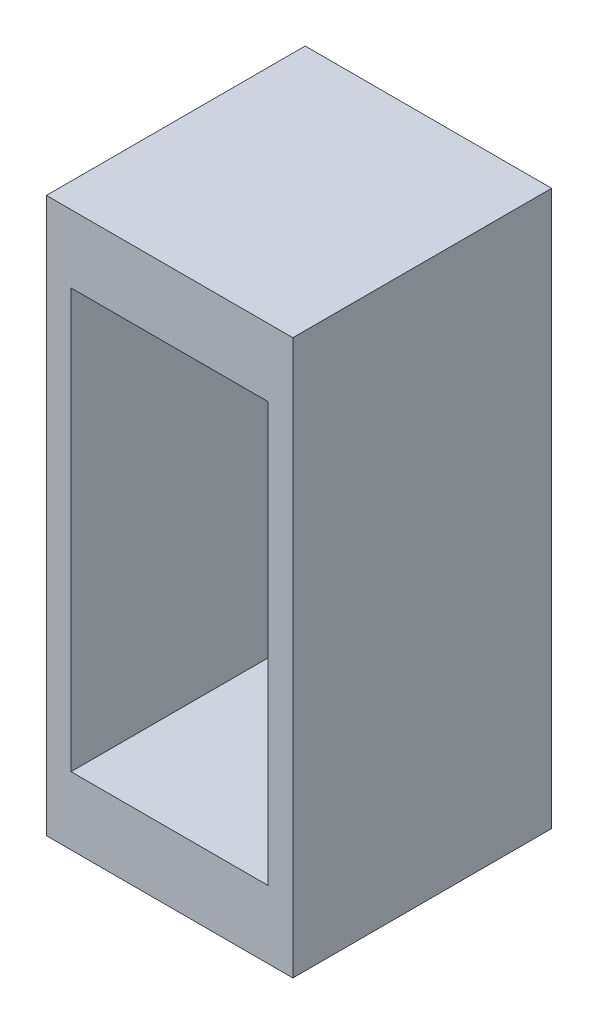
ISO-10303-21;
HEADER;
FILE_DESCRIPTION(('STEP AP214'),'2;1');
FILE_NAME('part.step','',(''),(''),'','','');
FILE_SCHEMA(('AUTOMOTIVE_DESIGN { 1 0 10303 214 1 1 1 1 }'));
ENDSEC;
DATA;
#1=APPLICATION_CONTEXT('core data for automotive mechanical design processes');
#2=APPLICATION_PROTOCOL_DEFINITION('international standard','automotive_design',2000,#1);
#3=PRODUCT_CONTEXT('',#1,'mechanical');
#4=PRODUCT('Part','Part','',(#3));
#5=PRODUCT_RELATED_PRODUCT_CATEGORY('part','',(#4));
#6=PRODUCT_DEFINITION_FORMATION('','',#4);
#7=PRODUCT_DEFINITION_CONTEXT('part definition',#1,'design');
#8=PRODUCT_DEFINITION('design','',#6,#7);
#9=PRODUCT_DEFINITION_SHAPE('','',#8);
#10=(LENGTH_UNIT() NAMED_UNIT(*) SI_UNIT(.MILLI.,.METRE.));
#11=(NAMED_UNIT(*) PLANE_ANGLE_UNIT() SI_UNIT($,.RADIAN.));
#12=(NAMED_UNIT(*) SI_UNIT($,.STERADIAN.) SOLID_ANGLE_UNIT());
#13=UNCERTAINTY_MEASURE_WITH_UNIT(LENGTH_MEASURE(1.E-05),#10,'distance_accuracy_value','');
#14=(GEOMETRIC_REPRESENTATION_CONTEXT(3) GLOBAL_UNCERTAINTY_ASSIGNED_CONTEXT((#13)) GLOBAL_UNIT_ASSIGNED_CONTEXT((#10,
#11,#12)) REPRESENTATION_CONTEXT('',''));
#15=CARTESIAN_POINT('',(0.,0.,0.));
#16=DIRECTION('',(0.,0.,1.));
#17=DIRECTION('',(1.,0.,0.));
#18=AXIS2_PLACEMENT_3D('',#15,#16,#17);
#19=CARTESIAN_POINT('',(0.,0.,26.67));
#20=DIRECTION('',(0.,0.,1.));
#21=DIRECTION('',(1.,0.,0.));
#22=AXIS2_PLACEMENT_3D('',#19,#20,#21);
#23=PLANE('',#22);
#24=DIRECTION('',(0.,-1.,0.));
#25=VECTOR('',#24,1.);
#26=CARTESIAN_POINT('',(-12.7,-28.575,26.67));
#27=LINE('',#26,#25);
#28=CARTESIAN_POINT('',(-12.7,28.575,26.67));
#29=VERTEX_POINT('',#28);
#30=CARTESIAN_POINT('',(-12.7,-28.575,26.67));
#31=VERTEX_POINT('',#30);
#32=EDGE_CURVE('E156',#29,#31,#27,.T.);
#33=ORIENTED_EDGE('',*,*,#32,.T.);
#34=DIRECTION('',(1.,0.,0.));
#35=VECTOR('',#34,1.);
#36=CARTESIAN_POINT('',(12.7,-28.575,26.67));
#37=LINE('',#36,#35);
#38=CARTESIAN_POINT('',(12.7,-28.575,26.67));
#39=VERTEX_POINT('',#38);
#40=EDGE_CURVE('E182',#31,#39,#37,.T.);
#41=ORIENTED_EDGE('',*,*,#40,.T.);
#42=DIRECTION('',(0.,1.,0.));
#43=VECTOR('',#42,1.);
#44=CARTESIAN_POINT('',(12.7,-28.575,26.67));
#45=LINE('',#44,#43);
#46=CARTESIAN_POINT('',(12.7,28.575,26.67));
#47=VERTEX_POINT('',#46);
#48=EDGE_CURVE('E170',#39,#47,#45,.T.);
#49=ORIENTED_EDGE('',*,*,#48,.T.);
#50=DIRECTION('',(-1.,0.,0.));
#51=VECTOR('',#50,1.);
#52=CARTESIAN_POINT('',(12.7,28.575,26.67));
#53=LINE('',#52,#51);
#54=EDGE_CURVE('E161',#47,#29,#53,.T.);
#55=ORIENTED_EDGE('',*,*,#54,.T.);
#56=EDGE_LOOP('',(#33,#41,#49,#55));
#57=FACE_BOUND('',#56,.T.);
#58=DIRECTION('',(-1.,0.,0.));
#59=VECTOR('',#58,1.);
#60=CARTESIAN_POINT('',(-10.16,21.59,26.67));
#61=LINE('',#60,#59);
#62=CARTESIAN_POINT('',(10.16,21.59,26.67));
#63=VERTEX_POINT('',#62);
#64=CARTESIAN_POINT('',(-10.16,21.59,26.67));
#65=VERTEX_POINT('',#64);
#66=EDGE_CURVE('E195',#63,#65,#61,.T.);
#67=ORIENTED_EDGE('',*,*,#66,.F.);
#68=DIRECTION('',(0.,1.,0.));
#69=VECTOR('',#68,1.);
#70=CARTESIAN_POINT('',(10.16,-21.59,26.67));
#71=LINE('',#70,#69);
#72=CARTESIAN_POINT('',(10.16,-21.59,26.67));
#73=VERTEX_POINT('',#72);
#74=EDGE_CURVE('E197',#73,#63,#71,.T.);
#75=ORIENTED_EDGE('',*,*,#74,.F.);
#76=DIRECTION('',(1.,0.,0.));
#77=VECTOR('',#76,1.);
#78=CARTESIAN_POINT('',(-10.16,-21.59,26.67));
#79=LINE('',#78,#77);
#80=CARTESIAN_POINT('',(-10.16,-21.59,26.67));
#81=VERTEX_POINT('',#80);
#82=EDGE_CURVE('E203',#81,#73,#79,.T.);
#83=ORIENTED_EDGE('',*,*,#82,.F.);
#84=DIRECTION('',(0.,-1.,0.));
#85=VECTOR('',#84,1.);
#86=CARTESIAN_POINT('',(-10.16,-21.59,26.67));
#87=LINE('',#86,#85);
#88=EDGE_CURVE('E198',#65,#81,#87,.T.);
#89=ORIENTED_EDGE('',*,*,#88,.F.);
#90=EDGE_LOOP('',(#67,#75,#83,#89));
#91=FACE_BOUND('',#90,.T.);
#92=ADVANCED_FACE('F33',(#57,#91),#23,.T.);
#93=CARTESIAN_POINT('',(0.,0.,0.));
#94=DIRECTION('',(0.,0.,1.));
#95=DIRECTION('',(1.,0.,0.));
#96=AXIS2_PLACEMENT_3D('',#93,#94,#95);
#97=PLANE('',#96);
#98=DIRECTION('',(1.,0.,0.));
#99=VECTOR('',#98,1.);
#100=CARTESIAN_POINT('',(-10.16,-21.59,0.));
#101=LINE('',#100,#99);
#102=CARTESIAN_POINT('',(-10.16,-21.59,0.));
#103=VERTEX_POINT('',#102);
#104=CARTESIAN_POINT('',(-6.35000000000001,-21.59,0.));
#105=VERTEX_POINT('',#104);
#106=EDGE_CURVE('E140',#103,#105,#101,.T.);
#107=ORIENTED_EDGE('',*,*,#106,.T.);
#108=DIRECTION('',(0.,1.,0.));
#109=VECTOR('',#108,1.);
#110=CARTESIAN_POINT('',(-6.35000000000002,28.576,0.));
#111=LINE('',#110,#109);
#112=CARTESIAN_POINT('',(-6.35000000000001,-28.575,0.));
#113=VERTEX_POINT('',#112);
#114=EDGE_CURVE('E124',#113,#105,#111,.T.);
#115=ORIENTED_EDGE('',*,*,#114,.F.);
#116=DIRECTION('',(1.,0.,0.));
#117=VECTOR('',#116,1.);
#118=CARTESIAN_POINT('',(12.7,-28.575,0.));
#119=LINE('',#118,#117);
#120=CARTESIAN_POINT('',(-12.7,-28.575,0.));
#121=VERTEX_POINT('',#120);
#122=EDGE_CURVE('E138',#121,#113,#119,.T.);
#123=ORIENTED_EDGE('',*,*,#122,.F.);
#124=DIRECTION('',(0.,-1.,0.));
#125=VECTOR('',#124,1.);
#126=CARTESIAN_POINT('',(-12.7,-28.575,0.));
#127=LINE('',#126,#125);
#128=CARTESIAN_POINT('',(-12.7,28.575,0.));
#129=VERTEX_POINT('',#128);
#130=EDGE_CURVE('E151',#129,#121,#127,.T.);
#131=ORIENTED_EDGE('',*,*,#130,.F.);
#132=DIRECTION('',(-1.,0.,0.));
#133=VECTOR('',#132,1.);
#134=CARTESIAN_POINT('',(12.7,28.575,0.));
#135=LINE('',#134,#133);
#136=CARTESIAN_POINT('',(12.7,28.575,0.));
#137=VERTEX_POINT('',#136);
#138=EDGE_CURVE('E149',#137,#129,#135,.T.);
#139=ORIENTED_EDGE('',*,*,#138,.F.);
#140=DIRECTION('',(0.,1.,0.));
#141=VECTOR('',#140,1.);
#142=CARTESIAN_POINT('',(12.7,-28.575,0.));
#143=LINE('',#142,#141);
#144=CARTESIAN_POINT('',(12.7,-28.575,0.));
#145=VERTEX_POINT('',#144);
#146=EDGE_CURVE('E146',#145,#137,#143,.T.);
#147=ORIENTED_EDGE('',*,*,#146,.F.);
#148=CARTESIAN_POINT('',(6.34999999999999,-28.575,0.));
#149=VERTEX_POINT('',#148);
#150=EDGE_CURVE('E147',#149,#145,#119,.T.);
#151=ORIENTED_EDGE('',*,*,#150,.F.);
#152=DIRECTION('',(0.,-1.,0.));
#153=VECTOR('',#152,1.);
#154=CARTESIAN_POINT('',(6.34999999999998,28.576,0.));
#155=LINE('',#154,#153);
#156=CARTESIAN_POINT('',(6.34999999999999,-21.59,0.));
#157=VERTEX_POINT('',#156);
#158=EDGE_CURVE('E141',#157,#149,#155,.T.);
#159=ORIENTED_EDGE('',*,*,#158,.F.);
#160=CARTESIAN_POINT('',(10.16,-21.59,0.));
#161=VERTEX_POINT('',#160);
#162=EDGE_CURVE('E219',#157,#161,#101,.T.);
#163=ORIENTED_EDGE('',*,*,#162,.T.);
#164=DIRECTION('',(0.,1.,0.));
#165=VECTOR('',#164,1.);
#166=CARTESIAN_POINT('',(10.16,-21.59,0.));
#167=LINE('',#166,#165);
#168=CARTESIAN_POINT('',(10.16,21.59,0.));
#169=VERTEX_POINT('',#168);
#170=EDGE_CURVE('E210',#161,#169,#167,.T.);
#171=ORIENTED_EDGE('',*,*,#170,.T.);
#172=DIRECTION('',(-1.,0.,0.));
#173=VECTOR('',#172,1.);
#174=CARTESIAN_POINT('',(-10.16,21.59,0.));
#175=LINE('',#174,#173);
#176=CARTESIAN_POINT('',(-10.16,21.59,0.));
#177=VERTEX_POINT('',#176);
#178=EDGE_CURVE('E213',#169,#177,#175,.T.);
#179=ORIENTED_EDGE('',*,*,#178,.T.);
#180=DIRECTION('',(0.,-1.,0.));
#181=VECTOR('',#180,1.);
#182=CARTESIAN_POINT('',(-10.16,-21.59,0.));
#183=LINE('',#182,#181);
#184=EDGE_CURVE('E217',#177,#103,#183,.T.);
#185=ORIENTED_EDGE('',*,*,#184,.T.);
#186=EDGE_LOOP('',(#107,#115,#123,#131,#139,#147,#151,#159,#163,#171,#179,#185));
#187=FACE_BOUND('',#186,.T.);
#188=ADVANCED_FACE('F136',(#187),#97,.F.);
#189=CARTESIAN_POINT('',(-12.7,-28.575,26.67));
#190=DIRECTION('',(1.,0.,0.));
#191=DIRECTION('',(0.,1.,0.));
#192=AXIS2_PLACEMENT_3D('',#189,#190,#191);
#193=PLANE('',#192);
#194=ORIENTED_EDGE('',*,*,#130,.T.);
#195=DIRECTION('',(0.,0.,-1.));
#196=VECTOR('',#195,1.);
#197=CARTESIAN_POINT('',(-12.7,-28.575,26.67));
#198=LINE('',#197,#196);
#199=EDGE_CURVE('E11',#31,#121,#198,.T.);
#200=ORIENTED_EDGE('',*,*,#199,.F.);
#201=ORIENTED_EDGE('',*,*,#32,.F.);
#202=DIRECTION('',(0.,0.,-1.));
#203=VECTOR('',#202,1.);
#204=CARTESIAN_POINT('',(-12.7,28.575,26.67));
#205=LINE('',#204,#203);
#206=EDGE_CURVE('E157',#29,#129,#205,.T.);
#207=ORIENTED_EDGE('',*,*,#206,.T.);
#208=EDGE_LOOP('',(#194,#200,#201,#207));
#209=FACE_BOUND('',#208,.T.);
#210=ADVANCED_FACE('F35',(#209),#193,.F.);
#211=CARTESIAN_POINT('',(12.7,-28.575,26.67));
#212=DIRECTION('',(0.,1.,0.));
#213=DIRECTION('',(-1.,0.,0.));
#214=AXIS2_PLACEMENT_3D('',#211,#212,#213);
#215=PLANE('',#214);
#216=ORIENTED_EDGE('',*,*,#122,.T.);
#217=DIRECTION('',(0.,0.,-1.));
#218=VECTOR('',#217,1.);
#219=CARTESIAN_POINT('',(-6.35000000000001,-28.575,-6.64962897824257));
#220=LINE('',#219,#218);
#221=CARTESIAN_POINT('',(-6.35000000000001,-28.575,6.05037102175743));
#222=VERTEX_POINT('',#221);
#223=EDGE_CURVE('E121',#222,#113,#220,.T.);
#224=ORIENTED_EDGE('',*,*,#223,.F.);
#225=DIRECTION('',(-1.,0.,0.));
#226=VECTOR('',#225,1.);
#227=CARTESIAN_POINT('',(-6.35000000000001,-28.575,6.05037102175743));
#228=LINE('',#227,#226);
#229=CARTESIAN_POINT('',(6.34999999999999,-28.575,6.05037102175743));
#230=VERTEX_POINT('',#229);
#231=EDGE_CURVE('E132',#230,#222,#228,.T.);
#232=ORIENTED_EDGE('',*,*,#231,.F.);
#233=DIRECTION('',(0.,0.,1.));
#234=VECTOR('',#233,1.);
#235=CARTESIAN_POINT('',(6.34999999999999,-28.575,-6.64962897824257));
#236=LINE('',#235,#234);
#237=EDGE_CURVE('E235',#149,#230,#236,.T.);
#238=ORIENTED_EDGE('',*,*,#237,.F.);
#239=ORIENTED_EDGE('',*,*,#150,.T.);
#240=DIRECTION('',(0.,0.,-1.));
#241=VECTOR('',#240,1.);
#242=CARTESIAN_POINT('',(12.7,-28.575,26.67));
#243=LINE('',#242,#241);
#244=EDGE_CURVE('E41',#39,#145,#243,.T.);
#245=ORIENTED_EDGE('',*,*,#244,.F.);
#246=ORIENTED_EDGE('',*,*,#40,.F.);
#247=ORIENTED_EDGE('',*,*,#199,.T.);
#248=EDGE_LOOP('',(#216,#224,#232,#238,#239,#245,#246,#247));
#249=FACE_BOUND('',#248,.T.);
#250=ADVANCED_FACE('F143',(#249),#215,.F.);
#251=CARTESIAN_POINT('',(12.7,-28.575,26.67));
#252=DIRECTION('',(-1.,0.,0.));
#253=DIRECTION('',(0.,0.,1.));
#254=AXIS2_PLACEMENT_3D('',#251,#252,#253);
#255=PLANE('',#254);
#256=ORIENTED_EDGE('',*,*,#146,.T.);
#257=DIRECTION('',(0.,0.,-1.));
#258=VECTOR('',#257,1.);
#259=CARTESIAN_POINT('',(12.7,28.575,26.67));
#260=LINE('',#259,#258);
#261=EDGE_CURVE('E160',#47,#137,#260,.T.);
#262=ORIENTED_EDGE('',*,*,#261,.F.);
#263=ORIENTED_EDGE('',*,*,#48,.F.);
#264=ORIENTED_EDGE('',*,*,#244,.T.);
#265=EDGE_LOOP('',(#256,#262,#263,#264));
#266=FACE_BOUND('',#265,.T.);
#267=ADVANCED_FACE('F168',(#266),#255,.F.);
#268=CARTESIAN_POINT('',(12.7,28.575,26.67));
#269=DIRECTION('',(0.,-1.,0.));
#270=DIRECTION('',(0.,0.,-1.));
#271=AXIS2_PLACEMENT_3D('',#268,#269,#270);
#272=PLANE('',#271);
#273=ORIENTED_EDGE('',*,*,#138,.T.);
#274=ORIENTED_EDGE('',*,*,#206,.F.);
#275=ORIENTED_EDGE('',*,*,#54,.F.);
#276=ORIENTED_EDGE('',*,*,#261,.T.);
#277=EDGE_LOOP('',(#273,#274,#275,#276));
#278=FACE_BOUND('',#277,.T.);
#279=ADVANCED_FACE('F176',(#278),#272,.F.);
#280=CARTESIAN_POINT('',(10.16,-21.59,26.67));
#281=DIRECTION('',(-1.,0.,0.));
#282=DIRECTION('',(0.,0.,1.));
#283=AXIS2_PLACEMENT_3D('',#280,#281,#282);
#284=PLANE('',#283);
#285=ORIENTED_EDGE('',*,*,#170,.F.);
#286=DIRECTION('',(0.,0.,-1.));
#287=VECTOR('',#286,1.);
#288=CARTESIAN_POINT('',(10.16,-21.59,26.67));
#289=LINE('',#288,#287);
#290=EDGE_CURVE('E209',#73,#161,#289,.T.);
#291=ORIENTED_EDGE('',*,*,#290,.F.);
#292=ORIENTED_EDGE('',*,*,#74,.T.);
#293=DIRECTION('',(0.,0.,-1.));
#294=VECTOR('',#293,1.);
#295=CARTESIAN_POINT('',(10.16,21.59,26.67));
#296=LINE('',#295,#294);
#297=EDGE_CURVE('E186',#63,#169,#296,.T.);
#298=ORIENTED_EDGE('',*,*,#297,.T.);
#299=EDGE_LOOP('',(#285,#291,#292,#298));
#300=FACE_BOUND('',#299,.T.);
#301=ADVANCED_FACE('F228',(#300),#284,.T.);
#302=CARTESIAN_POINT('',(-10.16,21.59,26.67));
#303=DIRECTION('',(0.,-1.,0.));
#304=DIRECTION('',(0.,0.,-1.));
#305=AXIS2_PLACEMENT_3D('',#302,#303,#304);
#306=PLANE('',#305);
#307=ORIENTED_EDGE('',*,*,#178,.F.);
#308=ORIENTED_EDGE('',*,*,#297,.F.);
#309=ORIENTED_EDGE('',*,*,#66,.T.);
#310=DIRECTION('',(0.,0.,-1.));
#311=VECTOR('',#310,1.);
#312=CARTESIAN_POINT('',(-10.16,21.59,26.67));
#313=LINE('',#312,#311);
#314=EDGE_CURVE('E223',#65,#177,#313,.T.);
#315=ORIENTED_EDGE('',*,*,#314,.T.);
#316=EDGE_LOOP('',(#307,#308,#309,#315));
#317=FACE_BOUND('',#316,.T.);
#318=ADVANCED_FACE('F261',(#317),#306,.T.);
#319=CARTESIAN_POINT('',(-10.16,-21.59,26.67));
#320=DIRECTION('',(1.,0.,0.));
#321=DIRECTION('',(0.,0.,-1.));
#322=AXIS2_PLACEMENT_3D('',#319,#320,#321);
#323=PLANE('',#322);
#324=ORIENTED_EDGE('',*,*,#184,.F.);
#325=ORIENTED_EDGE('',*,*,#314,.F.);
#326=ORIENTED_EDGE('',*,*,#88,.T.);
#327=DIRECTION('',(0.,0.,-1.));
#328=VECTOR('',#327,1.);
#329=CARTESIAN_POINT('',(-10.16,-21.59,26.67));
#330=LINE('',#329,#328);
#331=EDGE_CURVE('E56',#81,#103,#330,.T.);
#332=ORIENTED_EDGE('',*,*,#331,.T.);
#333=EDGE_LOOP('',(#324,#325,#326,#332));
#334=FACE_BOUND('',#333,.T.);
#335=ADVANCED_FACE('F258',(#334),#323,.T.);
#336=CARTESIAN_POINT('',(-10.16,-21.59,26.67));
#337=DIRECTION('',(0.,1.,0.));
#338=DIRECTION('',(0.,0.,1.));
#339=AXIS2_PLACEMENT_3D('',#336,#337,#338);
#340=PLANE('',#339);
#341=DIRECTION('',(0.,0.,-1.));
#342=VECTOR('',#341,1.);
#343=CARTESIAN_POINT('',(-6.35000000000001,-21.59,-6.64962897824257));
#344=LINE('',#343,#342);
#345=CARTESIAN_POINT('',(-6.35000000000002,-21.59,6.05037102175743));
#346=VERTEX_POINT('',#345);
#347=EDGE_CURVE('E236',#346,#105,#344,.T.);
#348=ORIENTED_EDGE('',*,*,#347,.T.);
#349=ORIENTED_EDGE('',*,*,#106,.F.);
#350=ORIENTED_EDGE('',*,*,#331,.F.);
#351=ORIENTED_EDGE('',*,*,#82,.T.);
#352=ORIENTED_EDGE('',*,*,#290,.T.);
#353=ORIENTED_EDGE('',*,*,#162,.F.);
#354=DIRECTION('',(0.,0.,1.));
#355=VECTOR('',#354,1.);
#356=CARTESIAN_POINT('',(6.34999999999999,-21.59,-6.64962897824257));
#357=LINE('',#356,#355);
#358=CARTESIAN_POINT('',(6.34999999999999,-21.59,6.05037102175743));
#359=VERTEX_POINT('',#358);
#360=EDGE_CURVE('E234',#157,#359,#357,.T.);
#361=ORIENTED_EDGE('',*,*,#360,.T.);
#362=DIRECTION('',(-1.,0.,0.));
#363=VECTOR('',#362,1.);
#364=CARTESIAN_POINT('',(-6.35000000000002,-21.59,6.05037102175743));
#365=LINE('',#364,#363);
#366=EDGE_CURVE('E214',#359,#346,#365,.T.);
#367=ORIENTED_EDGE('',*,*,#366,.T.);
#368=EDGE_LOOP('',(#348,#349,#350,#351,#352,#353,#361,#367));
#369=FACE_BOUND('',#368,.T.);
#370=ADVANCED_FACE('F232',(#369),#340,.T.);
#371=CARTESIAN_POINT('',(-6.35000000000002,28.576,6.05037102175743));
#372=DIRECTION('',(0.,0.,1.));
#373=DIRECTION('',(1.,0.,0.));
#374=AXIS2_PLACEMENT_3D('',#371,#372,#373);
#375=PLANE('',#374);
#376=DIRECTION('',(0.,-1.,0.));
#377=VECTOR('',#376,1.);
#378=CARTESIAN_POINT('',(6.34999999999998,28.576,6.05037102175743));
#379=LINE('',#378,#377);
#380=EDGE_CURVE('E48',#359,#230,#379,.T.);
#381=ORIENTED_EDGE('',*,*,#380,.T.);
#382=ORIENTED_EDGE('',*,*,#231,.T.);
#383=DIRECTION('',(0.,-1.,0.));
#384=VECTOR('',#383,1.);
#385=CARTESIAN_POINT('',(-6.35000000000002,28.576,6.05037102175743));
#386=LINE('',#385,#384);
#387=EDGE_CURVE('E127',#346,#222,#386,.T.);
#388=ORIENTED_EDGE('',*,*,#387,.F.);
#389=ORIENTED_EDGE('',*,*,#366,.F.);
#390=EDGE_LOOP('',(#381,#382,#388,#389));
#391=FACE_BOUND('',#390,.T.);
#392=ADVANCED_FACE('F245',(#391),#375,.F.);
#393=CARTESIAN_POINT('',(-6.35000000000002,28.576,-6.64962897824257));
#394=DIRECTION('',(-1.,0.,0.));
#395=DIRECTION('',(0.,0.,1.));
#396=AXIS2_PLACEMENT_3D('',#393,#394,#395);
#397=PLANE('',#396);
#398=ORIENTED_EDGE('',*,*,#114,.T.);
#399=ORIENTED_EDGE('',*,*,#347,.F.);
#400=ORIENTED_EDGE('',*,*,#387,.T.);
#401=ORIENTED_EDGE('',*,*,#223,.T.);
#402=EDGE_LOOP('',(#398,#399,#400,#401));
#403=FACE_BOUND('',#402,.T.);
#404=ADVANCED_FACE('F123',(#403),#397,.F.);
#405=CARTESIAN_POINT('',(6.34999999999998,28.576,-6.64962897824257));
#406=DIRECTION('',(1.,0.,0.));
#407=DIRECTION('',(0.,0.,-1.));
#408=AXIS2_PLACEMENT_3D('',#405,#406,#407);
#409=PLANE('',#408);
#410=ORIENTED_EDGE('',*,*,#158,.T.);
#411=ORIENTED_EDGE('',*,*,#237,.T.);
#412=ORIENTED_EDGE('',*,*,#380,.F.);
#413=ORIENTED_EDGE('',*,*,#360,.F.);
#414=EDGE_LOOP('',(#410,#411,#412,#413));
#415=FACE_BOUND('',#414,.T.);
#416=ADVANCED_FACE('F247',(#415),#409,.F.);
#417=CLOSED_SHELL('',(#92,#188,#210,#250,#267,#279,#301,#318,#335,#370,#392,#404,#416));
#418=MANIFOLD_SOLID_BREP('B2',#417);
#419=ADVANCED_BREP_SHAPE_REPRESENTATION('',(#18,#418),#14);
#420=SHAPE_DEFINITION_REPRESENTATION(#9,#419);
ENDSEC;
END-ISO-10303-21;
